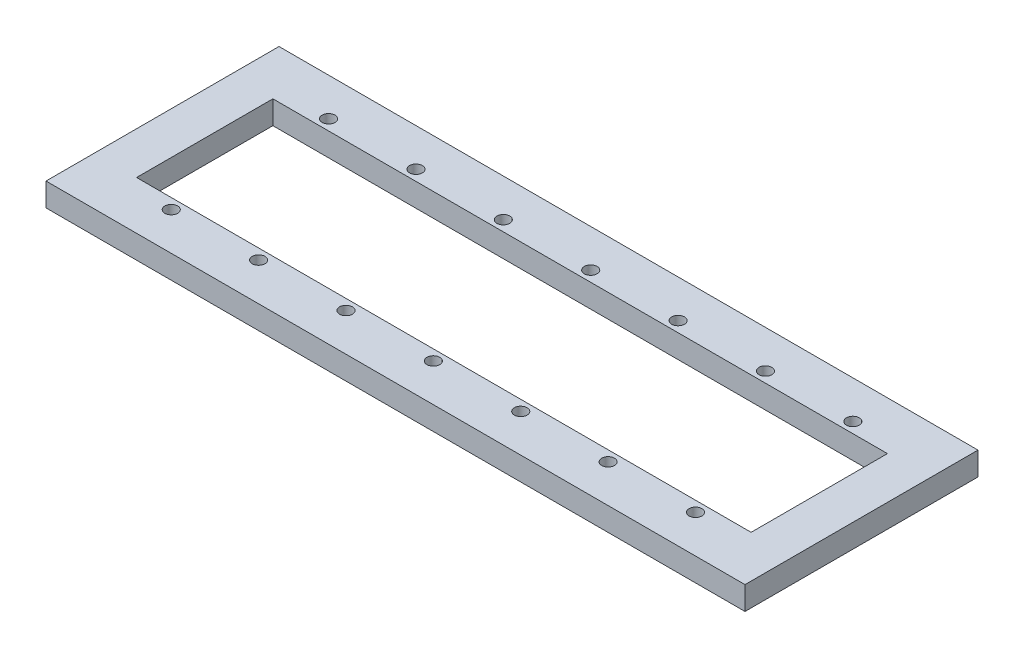
ISO-10303-21;
HEADER;
FILE_DESCRIPTION(('STEP AP214'),'2;1');
FILE_NAME('part.step','',(''),(''),'','','');
FILE_SCHEMA(('AUTOMOTIVE_DESIGN { 1 0 10303 214 1 1 1 1 }'));
ENDSEC;
DATA;
#1=APPLICATION_CONTEXT('core data for automotive mechanical design processes');
#2=APPLICATION_PROTOCOL_DEFINITION('international standard','automotive_design',2000,#1);
#3=PRODUCT_CONTEXT('',#1,'mechanical');
#4=PRODUCT('Part','Part','',(#3));
#5=PRODUCT_RELATED_PRODUCT_CATEGORY('part','',(#4));
#6=PRODUCT_DEFINITION_FORMATION('','',#4);
#7=PRODUCT_DEFINITION_CONTEXT('part definition',#1,'design');
#8=PRODUCT_DEFINITION('design','',#6,#7);
#9=PRODUCT_DEFINITION_SHAPE('','',#8);
#10=(LENGTH_UNIT() NAMED_UNIT(*) SI_UNIT(.MILLI.,.METRE.));
#11=(NAMED_UNIT(*) PLANE_ANGLE_UNIT() SI_UNIT($,.RADIAN.));
#12=(NAMED_UNIT(*) SI_UNIT($,.STERADIAN.) SOLID_ANGLE_UNIT());
#13=UNCERTAINTY_MEASURE_WITH_UNIT(LENGTH_MEASURE(1.E-05),#10,'distance_accuracy_value','');
#14=(GEOMETRIC_REPRESENTATION_CONTEXT(3) GLOBAL_UNCERTAINTY_ASSIGNED_CONTEXT((#13)) GLOBAL_UNIT_ASSIGNED_CONTEXT((#10,
#11,#12)) REPRESENTATION_CONTEXT('',''));
#15=CARTESIAN_POINT('',(0.,0.,0.));
#16=DIRECTION('',(0.,0.,1.));
#17=DIRECTION('',(1.,0.,0.));
#18=AXIS2_PLACEMENT_3D('',#15,#16,#17);
#19=CARTESIAN_POINT('',(-60.,4.,-20.));
#20=DIRECTION('',(1.,0.,0.));
#21=DIRECTION('',(0.,0.,-1.));
#22=AXIS2_PLACEMENT_3D('',#19,#20,#21);
#23=PLANE('',#22);
#24=DIRECTION('',(0.,0.,1.));
#25=VECTOR('',#24,1.);
#26=CARTESIAN_POINT('',(-60.,0.,-20.));
#27=LINE('',#26,#25);
#28=CARTESIAN_POINT('',(-60.,0.,-20.));
#29=VERTEX_POINT('',#28);
#30=CARTESIAN_POINT('',(-60.,0.,20.));
#31=VERTEX_POINT('',#30);
#32=EDGE_CURVE('E215',#29,#31,#27,.T.);
#33=ORIENTED_EDGE('',*,*,#32,.T.);
#34=DIRECTION('',(0.,-1.,0.));
#35=VECTOR('',#34,1.);
#36=CARTESIAN_POINT('',(-60.,4.,20.));
#37=LINE('',#36,#35);
#38=CARTESIAN_POINT('',(-60.,4.,20.));
#39=VERTEX_POINT('',#38);
#40=EDGE_CURVE('E11',#39,#31,#37,.T.);
#41=ORIENTED_EDGE('',*,*,#40,.F.);
#42=DIRECTION('',(0.,0.,1.));
#43=VECTOR('',#42,1.);
#44=CARTESIAN_POINT('',(-60.,4.,-20.));
#45=LINE('',#44,#43);
#46=CARTESIAN_POINT('',(-60.,4.,-20.));
#47=VERTEX_POINT('',#46);
#48=EDGE_CURVE('E218',#47,#39,#45,.T.);
#49=ORIENTED_EDGE('',*,*,#48,.F.);
#50=DIRECTION('',(0.,-1.,0.));
#51=VECTOR('',#50,1.);
#52=CARTESIAN_POINT('',(-60.,4.,-20.));
#53=LINE('',#52,#51);
#54=EDGE_CURVE('E228',#47,#29,#53,.T.);
#55=ORIENTED_EDGE('',*,*,#54,.T.);
#56=EDGE_LOOP('',(#33,#41,#49,#55));
#57=FACE_BOUND('',#56,.T.);
#58=ADVANCED_FACE('F33',(#57),#23,.F.);
#59=CARTESIAN_POINT('',(60.,4.,20.));
#60=DIRECTION('',(0.,0.,-1.));
#61=DIRECTION('',(-1.,0.,0.));
#62=AXIS2_PLACEMENT_3D('',#59,#60,#61);
#63=PLANE('',#62);
#64=DIRECTION('',(1.,0.,0.));
#65=VECTOR('',#64,1.);
#66=CARTESIAN_POINT('',(60.,0.,20.));
#67=LINE('',#66,#65);
#68=CARTESIAN_POINT('',(60.,0.,20.));
#69=VERTEX_POINT('',#68);
#70=EDGE_CURVE('E231',#31,#69,#67,.T.);
#71=ORIENTED_EDGE('',*,*,#70,.T.);
#72=DIRECTION('',(0.,-1.,0.));
#73=VECTOR('',#72,1.);
#74=CARTESIAN_POINT('',(60.,4.,20.));
#75=LINE('',#74,#73);
#76=CARTESIAN_POINT('',(60.,4.,20.));
#77=VERTEX_POINT('',#76);
#78=EDGE_CURVE('E40',#77,#69,#75,.T.);
#79=ORIENTED_EDGE('',*,*,#78,.F.);
#80=DIRECTION('',(1.,0.,0.));
#81=VECTOR('',#80,1.);
#82=CARTESIAN_POINT('',(60.,4.,20.));
#83=LINE('',#82,#81);
#84=EDGE_CURVE('E221',#39,#77,#83,.T.);
#85=ORIENTED_EDGE('',*,*,#84,.F.);
#86=ORIENTED_EDGE('',*,*,#40,.T.);
#87=EDGE_LOOP('',(#71,#79,#85,#86));
#88=FACE_BOUND('',#87,.T.);
#89=ADVANCED_FACE('F260',(#88),#63,.F.);
#90=CARTESIAN_POINT('',(60.,4.,-20.));
#91=DIRECTION('',(-1.,0.,0.));
#92=DIRECTION('',(0.,0.,1.));
#93=AXIS2_PLACEMENT_3D('',#90,#91,#92);
#94=PLANE('',#93);
#95=DIRECTION('',(0.,0.,-1.));
#96=VECTOR('',#95,1.);
#97=CARTESIAN_POINT('',(60.,0.,-20.));
#98=LINE('',#97,#96);
#99=CARTESIAN_POINT('',(60.,0.,-20.));
#100=VERTEX_POINT('',#99);
#101=EDGE_CURVE('E233',#69,#100,#98,.T.);
#102=ORIENTED_EDGE('',*,*,#101,.T.);
#103=DIRECTION('',(0.,-1.,0.));
#104=VECTOR('',#103,1.);
#105=CARTESIAN_POINT('',(60.,4.,-20.));
#106=LINE('',#105,#104);
#107=CARTESIAN_POINT('',(60.,4.,-20.));
#108=VERTEX_POINT('',#107);
#109=EDGE_CURVE('E238',#108,#100,#106,.T.);
#110=ORIENTED_EDGE('',*,*,#109,.F.);
#111=DIRECTION('',(0.,0.,-1.));
#112=VECTOR('',#111,1.);
#113=CARTESIAN_POINT('',(60.,4.,-20.));
#114=LINE('',#113,#112);
#115=EDGE_CURVE('E224',#77,#108,#114,.T.);
#116=ORIENTED_EDGE('',*,*,#115,.F.);
#117=ORIENTED_EDGE('',*,*,#78,.T.);
#118=EDGE_LOOP('',(#102,#110,#116,#117));
#119=FACE_BOUND('',#118,.T.);
#120=ADVANCED_FACE('F245',(#119),#94,.F.);
#121=CARTESIAN_POINT('',(60.,4.,-20.));
#122=DIRECTION('',(0.,0.,1.));
#123=DIRECTION('',(1.,0.,0.));
#124=AXIS2_PLACEMENT_3D('',#121,#122,#123);
#125=PLANE('',#124);
#126=DIRECTION('',(-1.,0.,0.));
#127=VECTOR('',#126,1.);
#128=CARTESIAN_POINT('',(60.,0.,-20.));
#129=LINE('',#128,#127);
#130=EDGE_CURVE('E222',#100,#29,#129,.T.);
#131=ORIENTED_EDGE('',*,*,#130,.T.);
#132=ORIENTED_EDGE('',*,*,#54,.F.);
#133=DIRECTION('',(-1.,0.,0.));
#134=VECTOR('',#133,1.);
#135=CARTESIAN_POINT('',(60.,4.,-20.));
#136=LINE('',#135,#134);
#137=EDGE_CURVE('E226',#108,#47,#136,.T.);
#138=ORIENTED_EDGE('',*,*,#137,.F.);
#139=ORIENTED_EDGE('',*,*,#109,.T.);
#140=EDGE_LOOP('',(#131,#132,#138,#139));
#141=FACE_BOUND('',#140,.T.);
#142=ADVANCED_FACE('F253',(#141),#125,.F.);
#143=CARTESIAN_POINT('',(0.,4.,0.));
#144=DIRECTION('',(0.,-1.,0.));
#145=DIRECTION('',(0.,0.,-1.));
#146=AXIS2_PLACEMENT_3D('',#143,#144,#145);
#147=PLANE('',#146);
#148=DIRECTION('',(1.,0.,0.));
#149=VECTOR('',#148,1.);
#150=CARTESIAN_POINT('',(-52.748568235,4.,11.7));
#151=LINE('',#150,#149);
#152=CARTESIAN_POINT('',(-52.748568235,4.,11.7));
#153=VERTEX_POINT('',#152);
#154=CARTESIAN_POINT('',(52.751431765,4.,11.7));
#155=VERTEX_POINT('',#154);
#156=EDGE_CURVE('E124',#153,#155,#151,.T.);
#157=ORIENTED_EDGE('',*,*,#156,.F.);
#158=DIRECTION('',(0.,0.,1.));
#159=VECTOR('',#158,1.);
#160=CARTESIAN_POINT('',(-52.748568235,4.,-11.7));
#161=LINE('',#160,#159);
#162=CARTESIAN_POINT('',(-52.748568235,4.,-11.7));
#163=VERTEX_POINT('',#162);
#164=EDGE_CURVE('E47',#163,#153,#161,.T.);
#165=ORIENTED_EDGE('',*,*,#164,.F.);
#166=DIRECTION('',(-1.,0.,0.));
#167=VECTOR('',#166,1.);
#168=CARTESIAN_POINT('',(-52.748568235,4.,-11.7));
#169=LINE('',#168,#167);
#170=CARTESIAN_POINT('',(52.751431765,4.,-11.7));
#171=VERTEX_POINT('',#170);
#172=EDGE_CURVE('E115',#171,#163,#169,.T.);
#173=ORIENTED_EDGE('',*,*,#172,.F.);
#174=DIRECTION('',(0.,0.,-1.));
#175=VECTOR('',#174,1.);
#176=CARTESIAN_POINT('',(52.751431765,4.,-11.7));
#177=LINE('',#176,#175);
#178=EDGE_CURVE('E118',#155,#171,#177,.T.);
#179=ORIENTED_EDGE('',*,*,#178,.F.);
#180=EDGE_LOOP('',(#157,#165,#173,#179));
#181=FACE_BOUND('',#180,.T.);
#182=CARTESIAN_POINT('',(45.001431765,4.,13.5));
#183=DIRECTION('',(0.,1.,0.));
#184=DIRECTION('',(0.,0.,1.));
#185=AXIS2_PLACEMENT_3D('',#182,#183,#184);
#186=CIRCLE('',#185,1.1);
#187=CARTESIAN_POINT('',(45.001431765,4.,14.6));
#188=VERTEX_POINT('',#187);
#189=EDGE_CURVE('E130',#188,#188,#186,.T.);
#190=ORIENTED_EDGE('',*,*,#189,.F.);
#191=EDGE_LOOP('',(#190));
#192=FACE_BOUND('',#191,.T.);
#193=CARTESIAN_POINT('',(45.001431765,4.,-13.5107129657163));
#194=DIRECTION('',(0.,1.,0.));
#195=DIRECTION('',(0.,0.,1.));
#196=AXIS2_PLACEMENT_3D('',#193,#194,#195);
#197=CIRCLE('',#196,1.1);
#198=CARTESIAN_POINT('',(45.001431765,4.,-12.4107129657163));
#199=VERTEX_POINT('',#198);
#200=EDGE_CURVE('E137',#199,#199,#197,.T.);
#201=ORIENTED_EDGE('',*,*,#200,.F.);
#202=EDGE_LOOP('',(#201));
#203=FACE_BOUND('',#202,.T.);
#204=CARTESIAN_POINT('',(30.001431765,4.,13.5));
#205=DIRECTION('',(0.,1.,0.));
#206=DIRECTION('',(0.,0.,1.));
#207=AXIS2_PLACEMENT_3D('',#204,#205,#206);
#208=CIRCLE('',#207,1.1);
#209=CARTESIAN_POINT('',(30.001431765,4.,14.6));
#210=VERTEX_POINT('',#209);
#211=EDGE_CURVE('E143',#210,#210,#208,.T.);
#212=ORIENTED_EDGE('',*,*,#211,.F.);
#213=EDGE_LOOP('',(#212));
#214=FACE_BOUND('',#213,.T.);
#215=CARTESIAN_POINT('',(30.001431765,4.,-13.5107129657163));
#216=DIRECTION('',(0.,1.,0.));
#217=DIRECTION('',(0.,0.,1.));
#218=AXIS2_PLACEMENT_3D('',#215,#216,#217);
#219=CIRCLE('',#218,1.1);
#220=CARTESIAN_POINT('',(30.001431765,4.,-12.4107129657163));
#221=VERTEX_POINT('',#220);
#222=EDGE_CURVE('E149',#221,#221,#219,.T.);
#223=ORIENTED_EDGE('',*,*,#222,.F.);
#224=EDGE_LOOP('',(#223));
#225=FACE_BOUND('',#224,.T.);
#226=CARTESIAN_POINT('',(15.001431765,4.,13.5));
#227=DIRECTION('',(0.,1.,0.));
#228=DIRECTION('',(0.,0.,1.));
#229=AXIS2_PLACEMENT_3D('',#226,#227,#228);
#230=CIRCLE('',#229,1.1);
#231=CARTESIAN_POINT('',(15.001431765,4.,14.6));
#232=VERTEX_POINT('',#231);
#233=EDGE_CURVE('E155',#232,#232,#230,.T.);
#234=ORIENTED_EDGE('',*,*,#233,.F.);
#235=EDGE_LOOP('',(#234));
#236=FACE_BOUND('',#235,.T.);
#237=CARTESIAN_POINT('',(15.001431765,4.,-13.5107129657163));
#238=DIRECTION('',(0.,1.,0.));
#239=DIRECTION('',(0.,0.,1.));
#240=AXIS2_PLACEMENT_3D('',#237,#238,#239);
#241=CIRCLE('',#240,1.1);
#242=CARTESIAN_POINT('',(15.001431765,4.,-12.4107129657163));
#243=VERTEX_POINT('',#242);
#244=EDGE_CURVE('E161',#243,#243,#241,.T.);
#245=ORIENTED_EDGE('',*,*,#244,.F.);
#246=EDGE_LOOP('',(#245));
#247=FACE_BOUND('',#246,.T.);
#248=CARTESIAN_POINT('',(0.00143176499999703,4.,13.5));
#249=DIRECTION('',(0.,1.,0.));
#250=DIRECTION('',(0.,0.,1.));
#251=AXIS2_PLACEMENT_3D('',#248,#249,#250);
#252=CIRCLE('',#251,1.1);
#253=CARTESIAN_POINT('',(0.00143176499999703,4.,14.6));
#254=VERTEX_POINT('',#253);
#255=EDGE_CURVE('E167',#254,#254,#252,.T.);
#256=ORIENTED_EDGE('',*,*,#255,.F.);
#257=EDGE_LOOP('',(#256));
#258=FACE_BOUND('',#257,.T.);
#259=CARTESIAN_POINT('',(0.00143176499999703,4.,-13.5107129657163));
#260=DIRECTION('',(0.,1.,0.));
#261=DIRECTION('',(0.,0.,1.));
#262=AXIS2_PLACEMENT_3D('',#259,#260,#261);
#263=CIRCLE('',#262,1.1);
#264=CARTESIAN_POINT('',(0.00143176499999703,4.,-12.4107129657163));
#265=VERTEX_POINT('',#264);
#266=EDGE_CURVE('E173',#265,#265,#263,.T.);
#267=ORIENTED_EDGE('',*,*,#266,.F.);
#268=EDGE_LOOP('',(#267));
#269=FACE_BOUND('',#268,.T.);
#270=CARTESIAN_POINT('',(-14.998568235,4.,13.5));
#271=DIRECTION('',(0.,1.,0.));
#272=DIRECTION('',(0.,0.,1.));
#273=AXIS2_PLACEMENT_3D('',#270,#271,#272);
#274=CIRCLE('',#273,1.1);
#275=CARTESIAN_POINT('',(-14.998568235,4.,14.6));
#276=VERTEX_POINT('',#275);
#277=EDGE_CURVE('E179',#276,#276,#274,.T.);
#278=ORIENTED_EDGE('',*,*,#277,.F.);
#279=EDGE_LOOP('',(#278));
#280=FACE_BOUND('',#279,.T.);
#281=CARTESIAN_POINT('',(-14.998568235,4.,-13.5107129657163));
#282=DIRECTION('',(0.,1.,0.));
#283=DIRECTION('',(0.,0.,1.));
#284=AXIS2_PLACEMENT_3D('',#281,#282,#283);
#285=CIRCLE('',#284,1.1);
#286=CARTESIAN_POINT('',(-14.998568235,4.,-12.4107129657163));
#287=VERTEX_POINT('',#286);
#288=EDGE_CURVE('E185',#287,#287,#285,.T.);
#289=ORIENTED_EDGE('',*,*,#288,.F.);
#290=EDGE_LOOP('',(#289));
#291=FACE_BOUND('',#290,.T.);
#292=CARTESIAN_POINT('',(-29.998568235,4.,13.5));
#293=DIRECTION('',(0.,1.,0.));
#294=DIRECTION('',(0.,0.,1.));
#295=AXIS2_PLACEMENT_3D('',#292,#293,#294);
#296=CIRCLE('',#295,1.1);
#297=CARTESIAN_POINT('',(-29.998568235,4.,14.6));
#298=VERTEX_POINT('',#297);
#299=EDGE_CURVE('E191',#298,#298,#296,.T.);
#300=ORIENTED_EDGE('',*,*,#299,.F.);
#301=EDGE_LOOP('',(#300));
#302=FACE_BOUND('',#301,.T.);
#303=CARTESIAN_POINT('',(-29.998568235,4.,-13.5107129657163));
#304=DIRECTION('',(0.,1.,0.));
#305=DIRECTION('',(0.,0.,1.));
#306=AXIS2_PLACEMENT_3D('',#303,#304,#305);
#307=CIRCLE('',#306,1.1);
#308=CARTESIAN_POINT('',(-29.998568235,4.,-12.4107129657163));
#309=VERTEX_POINT('',#308);
#310=EDGE_CURVE('E197',#309,#309,#307,.T.);
#311=ORIENTED_EDGE('',*,*,#310,.F.);
#312=EDGE_LOOP('',(#311));
#313=FACE_BOUND('',#312,.T.);
#314=CARTESIAN_POINT('',(-44.998568235,4.,13.5));
#315=DIRECTION('',(0.,1.,0.));
#316=DIRECTION('',(0.,0.,1.));
#317=AXIS2_PLACEMENT_3D('',#314,#315,#316);
#318=CIRCLE('',#317,1.1);
#319=CARTESIAN_POINT('',(-44.998568235,4.,14.6));
#320=VERTEX_POINT('',#319);
#321=EDGE_CURVE('E203',#320,#320,#318,.T.);
#322=ORIENTED_EDGE('',*,*,#321,.F.);
#323=EDGE_LOOP('',(#322));
#324=FACE_BOUND('',#323,.T.);
#325=CARTESIAN_POINT('',(-44.998568235,4.,-13.5107129657163));
#326=DIRECTION('',(0.,1.,0.));
#327=DIRECTION('',(0.,0.,1.));
#328=AXIS2_PLACEMENT_3D('',#325,#326,#327);
#329=CIRCLE('',#328,1.1);
#330=CARTESIAN_POINT('',(-44.998568235,4.,-12.4107129657163));
#331=VERTEX_POINT('',#330);
#332=EDGE_CURVE('E209',#331,#331,#329,.T.);
#333=ORIENTED_EDGE('',*,*,#332,.F.);
#334=EDGE_LOOP('',(#333));
#335=FACE_BOUND('',#334,.T.);
#336=ORIENTED_EDGE('',*,*,#48,.T.);
#337=ORIENTED_EDGE('',*,*,#84,.T.);
#338=ORIENTED_EDGE('',*,*,#115,.T.);
#339=ORIENTED_EDGE('',*,*,#137,.T.);
#340=EDGE_LOOP('',(#336,#337,#338,#339));
#341=FACE_BOUND('',#340,.T.);
#342=ADVANCED_FACE('F259',(#181,#192,#203,#214,#225,#236,#247,#258,#269,#280,#291,#302,#313,
#324,#335,#341),#147,.F.);
#343=CARTESIAN_POINT('',(0.,0.,0.));
#344=DIRECTION('',(0.,-1.,0.));
#345=DIRECTION('',(0.,0.,-1.));
#346=AXIS2_PLACEMENT_3D('',#343,#344,#345);
#347=PLANE('',#346);
#348=DIRECTION('',(0.,0.,1.));
#349=VECTOR('',#348,1.);
#350=CARTESIAN_POINT('',(-52.748568235,0.,-11.7));
#351=LINE('',#350,#349);
#352=CARTESIAN_POINT('',(-52.748568235,0.,-11.7));
#353=VERTEX_POINT('',#352);
#354=CARTESIAN_POINT('',(-52.748568235,0.,11.7));
#355=VERTEX_POINT('',#354);
#356=EDGE_CURVE('E99',#353,#355,#351,.T.);
#357=ORIENTED_EDGE('',*,*,#356,.T.);
#358=DIRECTION('',(1.,0.,0.));
#359=VECTOR('',#358,1.);
#360=CARTESIAN_POINT('',(-52.748568235,0.,11.7));
#361=LINE('',#360,#359);
#362=CARTESIAN_POINT('',(52.751431765,0.,11.7));
#363=VERTEX_POINT('',#362);
#364=EDGE_CURVE('E108',#355,#363,#361,.T.);
#365=ORIENTED_EDGE('',*,*,#364,.T.);
#366=DIRECTION('',(0.,0.,-1.));
#367=VECTOR('',#366,1.);
#368=CARTESIAN_POINT('',(52.751431765,0.,-11.7));
#369=LINE('',#368,#367);
#370=CARTESIAN_POINT('',(52.751431765,0.,-11.7));
#371=VERTEX_POINT('',#370);
#372=EDGE_CURVE('E55',#363,#371,#369,.T.);
#373=ORIENTED_EDGE('',*,*,#372,.T.);
#374=DIRECTION('',(-1.,0.,0.));
#375=VECTOR('',#374,1.);
#376=CARTESIAN_POINT('',(-52.748568235,0.,-11.7));
#377=LINE('',#376,#375);
#378=EDGE_CURVE('E105',#371,#353,#377,.T.);
#379=ORIENTED_EDGE('',*,*,#378,.T.);
#380=EDGE_LOOP('',(#357,#365,#373,#379));
#381=FACE_BOUND('',#380,.T.);
#382=CARTESIAN_POINT('',(45.001431765,0.,13.5));
#383=DIRECTION('',(0.,1.,0.));
#384=DIRECTION('',(0.,0.,1.));
#385=AXIS2_PLACEMENT_3D('',#382,#383,#384);
#386=CIRCLE('',#385,1.1);
#387=CARTESIAN_POINT('',(45.001431765,0.,14.6));
#388=VERTEX_POINT('',#387);
#389=EDGE_CURVE('E134',#388,#388,#386,.T.);
#390=ORIENTED_EDGE('',*,*,#389,.T.);
#391=EDGE_LOOP('',(#390));
#392=FACE_BOUND('',#391,.T.);
#393=CARTESIAN_POINT('',(45.001431765,0.,-13.5107129657163));
#394=DIRECTION('',(0.,1.,0.));
#395=DIRECTION('',(0.,0.,1.));
#396=AXIS2_PLACEMENT_3D('',#393,#394,#395);
#397=CIRCLE('',#396,1.1);
#398=CARTESIAN_POINT('',(45.001431765,0.,-12.4107129657163));
#399=VERTEX_POINT('',#398);
#400=EDGE_CURVE('E140',#399,#399,#397,.T.);
#401=ORIENTED_EDGE('',*,*,#400,.T.);
#402=EDGE_LOOP('',(#401));
#403=FACE_BOUND('',#402,.T.);
#404=CARTESIAN_POINT('',(30.001431765,0.,13.5));
#405=DIRECTION('',(0.,1.,0.));
#406=DIRECTION('',(0.,0.,1.));
#407=AXIS2_PLACEMENT_3D('',#404,#405,#406);
#408=CIRCLE('',#407,1.1);
#409=CARTESIAN_POINT('',(30.001431765,0.,14.6));
#410=VERTEX_POINT('',#409);
#411=EDGE_CURVE('E146',#410,#410,#408,.T.);
#412=ORIENTED_EDGE('',*,*,#411,.T.);
#413=EDGE_LOOP('',(#412));
#414=FACE_BOUND('',#413,.T.);
#415=CARTESIAN_POINT('',(30.001431765,0.,-13.5107129657163));
#416=DIRECTION('',(0.,1.,0.));
#417=DIRECTION('',(0.,0.,1.));
#418=AXIS2_PLACEMENT_3D('',#415,#416,#417);
#419=CIRCLE('',#418,1.1);
#420=CARTESIAN_POINT('',(30.001431765,0.,-12.4107129657163));
#421=VERTEX_POINT('',#420);
#422=EDGE_CURVE('E152',#421,#421,#419,.T.);
#423=ORIENTED_EDGE('',*,*,#422,.T.);
#424=EDGE_LOOP('',(#423));
#425=FACE_BOUND('',#424,.T.);
#426=CARTESIAN_POINT('',(15.001431765,0.,13.5));
#427=DIRECTION('',(0.,1.,0.));
#428=DIRECTION('',(0.,0.,1.));
#429=AXIS2_PLACEMENT_3D('',#426,#427,#428);
#430=CIRCLE('',#429,1.1);
#431=CARTESIAN_POINT('',(15.001431765,0.,14.6));
#432=VERTEX_POINT('',#431);
#433=EDGE_CURVE('E158',#432,#432,#430,.T.);
#434=ORIENTED_EDGE('',*,*,#433,.T.);
#435=EDGE_LOOP('',(#434));
#436=FACE_BOUND('',#435,.T.);
#437=CARTESIAN_POINT('',(15.001431765,0.,-13.5107129657163));
#438=DIRECTION('',(0.,1.,0.));
#439=DIRECTION('',(0.,0.,1.));
#440=AXIS2_PLACEMENT_3D('',#437,#438,#439);
#441=CIRCLE('',#440,1.1);
#442=CARTESIAN_POINT('',(15.001431765,0.,-12.4107129657163));
#443=VERTEX_POINT('',#442);
#444=EDGE_CURVE('E164',#443,#443,#441,.T.);
#445=ORIENTED_EDGE('',*,*,#444,.T.);
#446=EDGE_LOOP('',(#445));
#447=FACE_BOUND('',#446,.T.);
#448=CARTESIAN_POINT('',(0.00143176499999703,0.,13.5));
#449=DIRECTION('',(0.,1.,0.));
#450=DIRECTION('',(0.,0.,1.));
#451=AXIS2_PLACEMENT_3D('',#448,#449,#450);
#452=CIRCLE('',#451,1.1);
#453=CARTESIAN_POINT('',(0.00143176499999703,0.,14.6));
#454=VERTEX_POINT('',#453);
#455=EDGE_CURVE('E170',#454,#454,#452,.T.);
#456=ORIENTED_EDGE('',*,*,#455,.T.);
#457=EDGE_LOOP('',(#456));
#458=FACE_BOUND('',#457,.T.);
#459=CARTESIAN_POINT('',(0.00143176499999703,0.,-13.5107129657163));
#460=DIRECTION('',(0.,1.,0.));
#461=DIRECTION('',(0.,0.,1.));
#462=AXIS2_PLACEMENT_3D('',#459,#460,#461);
#463=CIRCLE('',#462,1.1);
#464=CARTESIAN_POINT('',(0.00143176499999703,0.,-12.4107129657163));
#465=VERTEX_POINT('',#464);
#466=EDGE_CURVE('E176',#465,#465,#463,.T.);
#467=ORIENTED_EDGE('',*,*,#466,.T.);
#468=EDGE_LOOP('',(#467));
#469=FACE_BOUND('',#468,.T.);
#470=CARTESIAN_POINT('',(-14.998568235,0.,13.5));
#471=DIRECTION('',(0.,1.,0.));
#472=DIRECTION('',(0.,0.,1.));
#473=AXIS2_PLACEMENT_3D('',#470,#471,#472);
#474=CIRCLE('',#473,1.1);
#475=CARTESIAN_POINT('',(-14.998568235,0.,14.6));
#476=VERTEX_POINT('',#475);
#477=EDGE_CURVE('E182',#476,#476,#474,.T.);
#478=ORIENTED_EDGE('',*,*,#477,.T.);
#479=EDGE_LOOP('',(#478));
#480=FACE_BOUND('',#479,.T.);
#481=CARTESIAN_POINT('',(-14.998568235,0.,-13.5107129657163));
#482=DIRECTION('',(0.,1.,0.));
#483=DIRECTION('',(0.,0.,1.));
#484=AXIS2_PLACEMENT_3D('',#481,#482,#483);
#485=CIRCLE('',#484,1.1);
#486=CARTESIAN_POINT('',(-14.998568235,0.,-12.4107129657163));
#487=VERTEX_POINT('',#486);
#488=EDGE_CURVE('E188',#487,#487,#485,.T.);
#489=ORIENTED_EDGE('',*,*,#488,.T.);
#490=EDGE_LOOP('',(#489));
#491=FACE_BOUND('',#490,.T.);
#492=CARTESIAN_POINT('',(-29.998568235,0.,13.5));
#493=DIRECTION('',(0.,1.,0.));
#494=DIRECTION('',(0.,0.,1.));
#495=AXIS2_PLACEMENT_3D('',#492,#493,#494);
#496=CIRCLE('',#495,1.1);
#497=CARTESIAN_POINT('',(-29.998568235,0.,14.6));
#498=VERTEX_POINT('',#497);
#499=EDGE_CURVE('E194',#498,#498,#496,.T.);
#500=ORIENTED_EDGE('',*,*,#499,.T.);
#501=EDGE_LOOP('',(#500));
#502=FACE_BOUND('',#501,.T.);
#503=CARTESIAN_POINT('',(-29.998568235,0.,-13.5107129657163));
#504=DIRECTION('',(0.,1.,0.));
#505=DIRECTION('',(0.,0.,1.));
#506=AXIS2_PLACEMENT_3D('',#503,#504,#505);
#507=CIRCLE('',#506,1.1);
#508=CARTESIAN_POINT('',(-29.998568235,0.,-12.4107129657163));
#509=VERTEX_POINT('',#508);
#510=EDGE_CURVE('E200',#509,#509,#507,.T.);
#511=ORIENTED_EDGE('',*,*,#510,.T.);
#512=EDGE_LOOP('',(#511));
#513=FACE_BOUND('',#512,.T.);
#514=CARTESIAN_POINT('',(-44.998568235,0.,13.5));
#515=DIRECTION('',(0.,1.,0.));
#516=DIRECTION('',(0.,0.,1.));
#517=AXIS2_PLACEMENT_3D('',#514,#515,#516);
#518=CIRCLE('',#517,1.1);
#519=CARTESIAN_POINT('',(-44.998568235,0.,14.6));
#520=VERTEX_POINT('',#519);
#521=EDGE_CURVE('E206',#520,#520,#518,.T.);
#522=ORIENTED_EDGE('',*,*,#521,.T.);
#523=EDGE_LOOP('',(#522));
#524=FACE_BOUND('',#523,.T.);
#525=CARTESIAN_POINT('',(-44.998568235,0.,-13.5107129657163));
#526=DIRECTION('',(0.,1.,0.));
#527=DIRECTION('',(0.,0.,1.));
#528=AXIS2_PLACEMENT_3D('',#525,#526,#527);
#529=CIRCLE('',#528,1.1);
#530=CARTESIAN_POINT('',(-44.998568235,0.,-12.4107129657163));
#531=VERTEX_POINT('',#530);
#532=EDGE_CURVE('E212',#531,#531,#529,.T.);
#533=ORIENTED_EDGE('',*,*,#532,.T.);
#534=EDGE_LOOP('',(#533));
#535=FACE_BOUND('',#534,.T.);
#536=ORIENTED_EDGE('',*,*,#32,.F.);
#537=ORIENTED_EDGE('',*,*,#130,.F.);
#538=ORIENTED_EDGE('',*,*,#101,.F.);
#539=ORIENTED_EDGE('',*,*,#70,.F.);
#540=EDGE_LOOP('',(#536,#537,#538,#539));
#541=FACE_BOUND('',#540,.T.);
#542=ADVANCED_FACE('F112',(#381,#392,#403,#414,#425,#436,#447,#458,#469,#480,#491,#502,#513,
#524,#535,#541),#347,.T.);
#543=CARTESIAN_POINT('',(-44.998568235,0.,-13.5107129657163));
#544=DIRECTION('',(0.,1.,0.));
#545=DIRECTION('',(0.,0.,1.));
#546=AXIS2_PLACEMENT_3D('',#543,#544,#545);
#547=CYLINDRICAL_SURFACE('',#546,1.1);
#548=ORIENTED_EDGE('',*,*,#532,.F.);
#549=EDGE_LOOP('',(#548));
#550=FACE_BOUND('',#549,.T.);
#551=ORIENTED_EDGE('',*,*,#332,.T.);
#552=EDGE_LOOP('',(#551));
#553=FACE_BOUND('',#552,.T.);
#554=ADVANCED_FACE('F272',(#550,#553),#547,.F.);
#555=CARTESIAN_POINT('',(-44.998568235,0.,13.5));
#556=DIRECTION('',(0.,1.,0.));
#557=DIRECTION('',(0.,0.,1.));
#558=AXIS2_PLACEMENT_3D('',#555,#556,#557);
#559=CYLINDRICAL_SURFACE('',#558,1.1);
#560=ORIENTED_EDGE('',*,*,#521,.F.);
#561=EDGE_LOOP('',(#560));
#562=FACE_BOUND('',#561,.T.);
#563=ORIENTED_EDGE('',*,*,#321,.T.);
#564=EDGE_LOOP('',(#563));
#565=FACE_BOUND('',#564,.T.);
#566=ADVANCED_FACE('F278',(#562,#565),#559,.F.);
#567=CARTESIAN_POINT('',(-29.998568235,0.,-13.5107129657163));
#568=DIRECTION('',(0.,1.,0.));
#569=DIRECTION('',(0.,0.,1.));
#570=AXIS2_PLACEMENT_3D('',#567,#568,#569);
#571=CYLINDRICAL_SURFACE('',#570,1.1);
#572=ORIENTED_EDGE('',*,*,#510,.F.);
#573=EDGE_LOOP('',(#572));
#574=FACE_BOUND('',#573,.T.);
#575=ORIENTED_EDGE('',*,*,#310,.T.);
#576=EDGE_LOOP('',(#575));
#577=FACE_BOUND('',#576,.T.);
#578=ADVANCED_FACE('F282',(#574,#577),#571,.F.);
#579=CARTESIAN_POINT('',(-29.998568235,0.,13.5));
#580=DIRECTION('',(0.,1.,0.));
#581=DIRECTION('',(0.,0.,1.));
#582=AXIS2_PLACEMENT_3D('',#579,#580,#581);
#583=CYLINDRICAL_SURFACE('',#582,1.1);
#584=ORIENTED_EDGE('',*,*,#499,.F.);
#585=EDGE_LOOP('',(#584));
#586=FACE_BOUND('',#585,.T.);
#587=ORIENTED_EDGE('',*,*,#299,.T.);
#588=EDGE_LOOP('',(#587));
#589=FACE_BOUND('',#588,.T.);
#590=ADVANCED_FACE('F286',(#586,#589),#583,.F.);
#591=CARTESIAN_POINT('',(-14.998568235,0.,-13.5107129657163));
#592=DIRECTION('',(0.,1.,0.));
#593=DIRECTION('',(0.,0.,1.));
#594=AXIS2_PLACEMENT_3D('',#591,#592,#593);
#595=CYLINDRICAL_SURFACE('',#594,1.1);
#596=ORIENTED_EDGE('',*,*,#488,.F.);
#597=EDGE_LOOP('',(#596));
#598=FACE_BOUND('',#597,.T.);
#599=ORIENTED_EDGE('',*,*,#288,.T.);
#600=EDGE_LOOP('',(#599));
#601=FACE_BOUND('',#600,.T.);
#602=ADVANCED_FACE('F290',(#598,#601),#595,.F.);
#603=CARTESIAN_POINT('',(-14.998568235,0.,13.5));
#604=DIRECTION('',(0.,1.,0.));
#605=DIRECTION('',(0.,0.,1.));
#606=AXIS2_PLACEMENT_3D('',#603,#604,#605);
#607=CYLINDRICAL_SURFACE('',#606,1.1);
#608=ORIENTED_EDGE('',*,*,#477,.F.);
#609=EDGE_LOOP('',(#608));
#610=FACE_BOUND('',#609,.T.);
#611=ORIENTED_EDGE('',*,*,#277,.T.);
#612=EDGE_LOOP('',(#611));
#613=FACE_BOUND('',#612,.T.);
#614=ADVANCED_FACE('F294',(#610,#613),#607,.F.);
#615=CARTESIAN_POINT('',(0.00143176499999703,0.,-13.5107129657163));
#616=DIRECTION('',(0.,1.,0.));
#617=DIRECTION('',(0.,0.,1.));
#618=AXIS2_PLACEMENT_3D('',#615,#616,#617);
#619=CYLINDRICAL_SURFACE('',#618,1.1);
#620=ORIENTED_EDGE('',*,*,#466,.F.);
#621=EDGE_LOOP('',(#620));
#622=FACE_BOUND('',#621,.T.);
#623=ORIENTED_EDGE('',*,*,#266,.T.);
#624=EDGE_LOOP('',(#623));
#625=FACE_BOUND('',#624,.T.);
#626=ADVANCED_FACE('F298',(#622,#625),#619,.F.);
#627=CARTESIAN_POINT('',(0.00143176499999703,0.,13.5));
#628=DIRECTION('',(0.,1.,0.));
#629=DIRECTION('',(0.,0.,1.));
#630=AXIS2_PLACEMENT_3D('',#627,#628,#629);
#631=CYLINDRICAL_SURFACE('',#630,1.1);
#632=ORIENTED_EDGE('',*,*,#455,.F.);
#633=EDGE_LOOP('',(#632));
#634=FACE_BOUND('',#633,.T.);
#635=ORIENTED_EDGE('',*,*,#255,.T.);
#636=EDGE_LOOP('',(#635));
#637=FACE_BOUND('',#636,.T.);
#638=ADVANCED_FACE('F302',(#634,#637),#631,.F.);
#639=CARTESIAN_POINT('',(15.001431765,0.,-13.5107129657163));
#640=DIRECTION('',(0.,1.,0.));
#641=DIRECTION('',(0.,0.,1.));
#642=AXIS2_PLACEMENT_3D('',#639,#640,#641);
#643=CYLINDRICAL_SURFACE('',#642,1.1);
#644=ORIENTED_EDGE('',*,*,#444,.F.);
#645=EDGE_LOOP('',(#644));
#646=FACE_BOUND('',#645,.T.);
#647=ORIENTED_EDGE('',*,*,#244,.T.);
#648=EDGE_LOOP('',(#647));
#649=FACE_BOUND('',#648,.T.);
#650=ADVANCED_FACE('F306',(#646,#649),#643,.F.);
#651=CARTESIAN_POINT('',(15.001431765,0.,13.5));
#652=DIRECTION('',(0.,1.,0.));
#653=DIRECTION('',(0.,0.,1.));
#654=AXIS2_PLACEMENT_3D('',#651,#652,#653);
#655=CYLINDRICAL_SURFACE('',#654,1.1);
#656=ORIENTED_EDGE('',*,*,#433,.F.);
#657=EDGE_LOOP('',(#656));
#658=FACE_BOUND('',#657,.T.);
#659=ORIENTED_EDGE('',*,*,#233,.T.);
#660=EDGE_LOOP('',(#659));
#661=FACE_BOUND('',#660,.T.);
#662=ADVANCED_FACE('F310',(#658,#661),#655,.F.);
#663=CARTESIAN_POINT('',(30.001431765,0.,-13.5107129657163));
#664=DIRECTION('',(0.,1.,0.));
#665=DIRECTION('',(0.,0.,1.));
#666=AXIS2_PLACEMENT_3D('',#663,#664,#665);
#667=CYLINDRICAL_SURFACE('',#666,1.1);
#668=ORIENTED_EDGE('',*,*,#422,.F.);
#669=EDGE_LOOP('',(#668));
#670=FACE_BOUND('',#669,.T.);
#671=ORIENTED_EDGE('',*,*,#222,.T.);
#672=EDGE_LOOP('',(#671));
#673=FACE_BOUND('',#672,.T.);
#674=ADVANCED_FACE('F314',(#670,#673),#667,.F.);
#675=CARTESIAN_POINT('',(30.001431765,0.,13.5));
#676=DIRECTION('',(0.,1.,0.));
#677=DIRECTION('',(0.,0.,1.));
#678=AXIS2_PLACEMENT_3D('',#675,#676,#677);
#679=CYLINDRICAL_SURFACE('',#678,1.1);
#680=ORIENTED_EDGE('',*,*,#411,.F.);
#681=EDGE_LOOP('',(#680));
#682=FACE_BOUND('',#681,.T.);
#683=ORIENTED_EDGE('',*,*,#211,.T.);
#684=EDGE_LOOP('',(#683));
#685=FACE_BOUND('',#684,.T.);
#686=ADVANCED_FACE('F318',(#682,#685),#679,.F.);
#687=CARTESIAN_POINT('',(45.001431765,0.,-13.5107129657163));
#688=DIRECTION('',(0.,1.,0.));
#689=DIRECTION('',(0.,0.,1.));
#690=AXIS2_PLACEMENT_3D('',#687,#688,#689);
#691=CYLINDRICAL_SURFACE('',#690,1.1);
#692=ORIENTED_EDGE('',*,*,#400,.F.);
#693=EDGE_LOOP('',(#692));
#694=FACE_BOUND('',#693,.T.);
#695=ORIENTED_EDGE('',*,*,#200,.T.);
#696=EDGE_LOOP('',(#695));
#697=FACE_BOUND('',#696,.T.);
#698=ADVANCED_FACE('F322',(#694,#697),#691,.F.);
#699=CARTESIAN_POINT('',(45.001431765,0.,13.5));
#700=DIRECTION('',(0.,1.,0.));
#701=DIRECTION('',(0.,0.,1.));
#702=AXIS2_PLACEMENT_3D('',#699,#700,#701);
#703=CYLINDRICAL_SURFACE('',#702,1.1);
#704=ORIENTED_EDGE('',*,*,#389,.F.);
#705=EDGE_LOOP('',(#704));
#706=FACE_BOUND('',#705,.T.);
#707=ORIENTED_EDGE('',*,*,#189,.T.);
#708=EDGE_LOOP('',(#707));
#709=FACE_BOUND('',#708,.T.);
#710=ADVANCED_FACE('F326',(#706,#709),#703,.F.);
#711=CARTESIAN_POINT('',(-52.748568235,0.,-11.7));
#712=DIRECTION('',(-1.,0.,0.));
#713=DIRECTION('',(0.,0.,1.));
#714=AXIS2_PLACEMENT_3D('',#711,#712,#713);
#715=PLANE('',#714);
#716=ORIENTED_EDGE('',*,*,#164,.T.);
#717=DIRECTION('',(0.,1.,0.));
#718=VECTOR('',#717,1.);
#719=CARTESIAN_POINT('',(-52.748568235,0.,11.7));
#720=LINE('',#719,#718);
#721=EDGE_CURVE('E95',#355,#153,#720,.T.);
#722=ORIENTED_EDGE('',*,*,#721,.F.);
#723=ORIENTED_EDGE('',*,*,#356,.F.);
#724=DIRECTION('',(0.,1.,0.));
#725=VECTOR('',#724,1.);
#726=CARTESIAN_POINT('',(-52.748568235,0.,-11.7));
#727=LINE('',#726,#725);
#728=EDGE_CURVE('E128',#353,#163,#727,.T.);
#729=ORIENTED_EDGE('',*,*,#728,.T.);
#730=EDGE_LOOP('',(#716,#722,#723,#729));
#731=FACE_BOUND('',#730,.T.);
#732=ADVANCED_FACE('F97',(#731),#715,.F.);
#733=CARTESIAN_POINT('',(-52.748568235,0.,-11.7));
#734=DIRECTION('',(0.,0.,-1.));
#735=DIRECTION('',(-1.,0.,0.));
#736=AXIS2_PLACEMENT_3D('',#733,#734,#735);
#737=PLANE('',#736);
#738=ORIENTED_EDGE('',*,*,#172,.T.);
#739=ORIENTED_EDGE('',*,*,#728,.F.);
#740=ORIENTED_EDGE('',*,*,#378,.F.);
#741=DIRECTION('',(0.,1.,0.));
#742=VECTOR('',#741,1.);
#743=CARTESIAN_POINT('',(52.751431765,0.,-11.7));
#744=LINE('',#743,#742);
#745=EDGE_CURVE('E131',#371,#171,#744,.T.);
#746=ORIENTED_EDGE('',*,*,#745,.T.);
#747=EDGE_LOOP('',(#738,#739,#740,#746));
#748=FACE_BOUND('',#747,.T.);
#749=ADVANCED_FACE('F333',(#748),#737,.F.);
#750=CARTESIAN_POINT('',(52.751431765,0.,-11.7));
#751=DIRECTION('',(1.,0.,0.));
#752=DIRECTION('',(0.,0.,-1.));
#753=AXIS2_PLACEMENT_3D('',#750,#751,#752);
#754=PLANE('',#753);
#755=ORIENTED_EDGE('',*,*,#178,.T.);
#756=ORIENTED_EDGE('',*,*,#745,.F.);
#757=ORIENTED_EDGE('',*,*,#372,.F.);
#758=DIRECTION('',(0.,1.,0.));
#759=VECTOR('',#758,1.);
#760=CARTESIAN_POINT('',(52.751431765,0.,11.7));
#761=LINE('',#760,#759);
#762=EDGE_CURVE('E104',#363,#155,#761,.T.);
#763=ORIENTED_EDGE('',*,*,#762,.T.);
#764=EDGE_LOOP('',(#755,#756,#757,#763));
#765=FACE_BOUND('',#764,.T.);
#766=ADVANCED_FACE('F336',(#765),#754,.F.);
#767=CARTESIAN_POINT('',(-52.748568235,0.,11.7));
#768=DIRECTION('',(0.,0.,1.));
#769=DIRECTION('',(1.,0.,0.));
#770=AXIS2_PLACEMENT_3D('',#767,#768,#769);
#771=PLANE('',#770);
#772=ORIENTED_EDGE('',*,*,#156,.T.);
#773=ORIENTED_EDGE('',*,*,#762,.F.);
#774=ORIENTED_EDGE('',*,*,#364,.F.);
#775=ORIENTED_EDGE('',*,*,#721,.T.);
#776=EDGE_LOOP('',(#772,#773,#774,#775));
#777=FACE_BOUND('',#776,.T.);
#778=ADVANCED_FACE('F109',(#777),#771,.F.);
#779=CLOSED_SHELL('',(#58,#89,#120,#142,#342,#542,#554,#566,#578,#590,#602,#614,#626,#638,#650,
#662,#674,#686,#698,#710,#732,#749,#766,#778));
#780=MANIFOLD_SOLID_BREP('B2',#779);
#781=ADVANCED_BREP_SHAPE_REPRESENTATION('',(#18,#780),#14);
#782=SHAPE_DEFINITION_REPRESENTATION(#9,#781);
ENDSEC;
END-ISO-10303-21;
